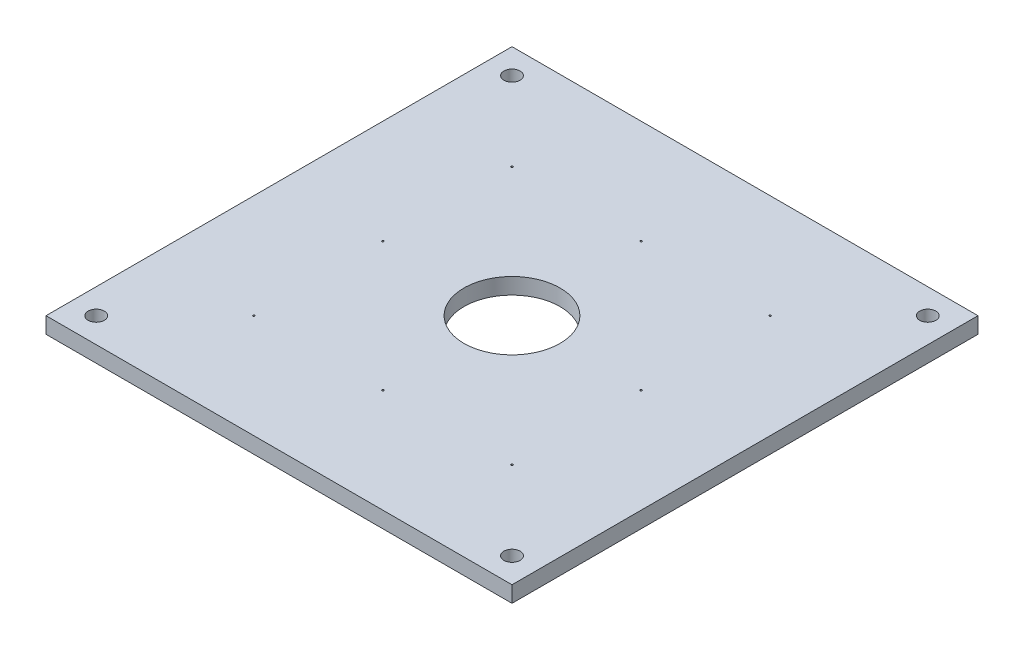
ISO-10303-21;
HEADER;
FILE_DESCRIPTION(('STEP AP214'),'2;1');
FILE_NAME('part.step','',(''),(''),'','','');
FILE_SCHEMA(('AUTOMOTIVE_DESIGN { 1 0 10303 214 1 1 1 1 }'));
ENDSEC;
DATA;
#1=APPLICATION_CONTEXT('core data for automotive mechanical design processes');
#2=APPLICATION_PROTOCOL_DEFINITION('international standard','automotive_design',2000,#1);
#3=PRODUCT_CONTEXT('',#1,'mechanical');
#4=PRODUCT('Part','Part','',(#3));
#5=PRODUCT_RELATED_PRODUCT_CATEGORY('part','',(#4));
#6=PRODUCT_DEFINITION_FORMATION('','',#4);
#7=PRODUCT_DEFINITION_CONTEXT('part definition',#1,'design');
#8=PRODUCT_DEFINITION('design','',#6,#7);
#9=PRODUCT_DEFINITION_SHAPE('','',#8);
#10=(LENGTH_UNIT() NAMED_UNIT(*) SI_UNIT(.MILLI.,.METRE.));
#11=(NAMED_UNIT(*) PLANE_ANGLE_UNIT() SI_UNIT($,.RADIAN.));
#12=(NAMED_UNIT(*) SI_UNIT($,.STERADIAN.) SOLID_ANGLE_UNIT());
#13=UNCERTAINTY_MEASURE_WITH_UNIT(LENGTH_MEASURE(1.E-05),#10,'distance_accuracy_value','');
#14=(GEOMETRIC_REPRESENTATION_CONTEXT(3) GLOBAL_UNCERTAINTY_ASSIGNED_CONTEXT((#13)) GLOBAL_UNIT_ASSIGNED_CONTEXT((#10,
#11,#12)) REPRESENTATION_CONTEXT('',''));
#15=CARTESIAN_POINT('',(0.,0.,0.));
#16=DIRECTION('',(0.,0.,1.));
#17=DIRECTION('',(1.,0.,0.));
#18=AXIS2_PLACEMENT_3D('',#15,#16,#17);
#19=CARTESIAN_POINT('',(0.,4.5,-130.));
#20=DIRECTION('',(0.,-1.,0.));
#21=DIRECTION('',(0.,0.,-1.));
#22=AXIS2_PLACEMENT_3D('',#19,#20,#21);
#23=PLANE('',#22);
#24=CARTESIAN_POINT('',(101.,4.5,-101.));
#25=DIRECTION('',(0.,-1.,0.));
#26=DIRECTION('',(0.,0.,-1.));
#27=AXIS2_PLACEMENT_3D('',#24,#25,#26);
#28=CIRCLE('',#27,0.25);
#29=CARTESIAN_POINT('',(101.,4.5,-101.25));
#30=VERTEX_POINT('',#29);
#31=EDGE_CURVE('E178',#30,#30,#28,.T.);
#32=ORIENTED_EDGE('',*,*,#31,.T.);
#33=EDGE_LOOP('',(#32));
#34=FACE_BOUND('',#33,.T.);
#35=CARTESIAN_POINT('',(29.0000000000004,4.5,-101.));
#36=DIRECTION('',(0.,-1.,0.));
#37=DIRECTION('',(0.,0.,-1.));
#38=AXIS2_PLACEMENT_3D('',#35,#36,#37);
#39=CIRCLE('',#38,0.25);
#40=CARTESIAN_POINT('',(29.0000000000004,4.5,-101.25));
#41=VERTEX_POINT('',#40);
#42=EDGE_CURVE('E172',#41,#41,#39,.T.);
#43=ORIENTED_EDGE('',*,*,#42,.T.);
#44=EDGE_LOOP('',(#43));
#45=FACE_BOUND('',#44,.T.);
#46=CARTESIAN_POINT('',(101.,4.5,-29.0000000000002));
#47=DIRECTION('',(0.,-1.,0.));
#48=DIRECTION('',(0.,0.,-1.));
#49=AXIS2_PLACEMENT_3D('',#46,#47,#48);
#50=CIRCLE('',#49,0.25);
#51=CARTESIAN_POINT('',(101.,4.5,-29.2500000000002));
#52=VERTEX_POINT('',#51);
#53=EDGE_CURVE('E166',#52,#52,#50,.T.);
#54=ORIENTED_EDGE('',*,*,#53,.T.);
#55=EDGE_LOOP('',(#54));
#56=FACE_BOUND('',#55,.T.);
#57=CARTESIAN_POINT('',(28.9999999999999,4.5,-29.));
#58=DIRECTION('',(0.,-1.,0.));
#59=DIRECTION('',(0.,0.,-1.));
#60=AXIS2_PLACEMENT_3D('',#57,#58,#59);
#61=CIRCLE('',#60,0.25);
#62=CARTESIAN_POINT('',(28.9999999999999,4.5,-29.25));
#63=VERTEX_POINT('',#62);
#64=EDGE_CURVE('E160',#63,#63,#61,.T.);
#65=ORIENTED_EDGE('',*,*,#64,.T.);
#66=EDGE_LOOP('',(#65));
#67=FACE_BOUND('',#66,.T.);
#68=CARTESIAN_POINT('',(64.9999999999996,4.5,-101.));
#69=DIRECTION('',(0.,-1.,0.));
#70=DIRECTION('',(0.,0.,-1.));
#71=AXIS2_PLACEMENT_3D('',#68,#69,#70);
#72=CIRCLE('',#71,0.249999999999986);
#73=CARTESIAN_POINT('',(64.9999999999996,4.5,-101.25));
#74=VERTEX_POINT('',#73);
#75=EDGE_CURVE('E154',#74,#74,#72,.T.);
#76=ORIENTED_EDGE('',*,*,#75,.T.);
#77=EDGE_LOOP('',(#76));
#78=FACE_BOUND('',#77,.T.);
#79=CARTESIAN_POINT('',(101.,4.5,-65.0000000000002));
#80=DIRECTION('',(0.,-1.,0.));
#81=DIRECTION('',(0.,0.,-1.));
#82=AXIS2_PLACEMENT_3D('',#79,#80,#81);
#83=CIRCLE('',#82,0.25);
#84=CARTESIAN_POINT('',(101.,4.5,-65.2500000000002));
#85=VERTEX_POINT('',#84);
#86=EDGE_CURVE('E148',#85,#85,#83,.T.);
#87=ORIENTED_EDGE('',*,*,#86,.T.);
#88=EDGE_LOOP('',(#87));
#89=FACE_BOUND('',#88,.T.);
#90=CARTESIAN_POINT('',(65.0000000000001,4.5,-29.));
#91=DIRECTION('',(0.,-1.,0.));
#92=DIRECTION('',(0.,0.,-1.));
#93=AXIS2_PLACEMENT_3D('',#90,#91,#92);
#94=CIRCLE('',#93,0.25);
#95=CARTESIAN_POINT('',(65.0000000000001,4.5,-29.25));
#96=VERTEX_POINT('',#95);
#97=EDGE_CURVE('E142',#96,#96,#94,.T.);
#98=ORIENTED_EDGE('',*,*,#97,.T.);
#99=EDGE_LOOP('',(#98));
#100=FACE_BOUND('',#99,.T.);
#101=CARTESIAN_POINT('',(29.,4.5,-65.));
#102=DIRECTION('',(0.,-1.,0.));
#103=DIRECTION('',(0.,0.,-1.));
#104=AXIS2_PLACEMENT_3D('',#101,#102,#103);
#105=CIRCLE('',#104,0.25);
#106=CARTESIAN_POINT('',(29.,4.5,-65.25));
#107=VERTEX_POINT('',#106);
#108=EDGE_CURVE('E136',#107,#107,#105,.T.);
#109=ORIENTED_EDGE('',*,*,#108,.T.);
#110=EDGE_LOOP('',(#109));
#111=FACE_BOUND('',#110,.T.);
#112=CARTESIAN_POINT('',(7.00000000000001,4.5,-7.00000000000001));
#113=DIRECTION('',(0.,1.,0.));
#114=DIRECTION('',(0.,0.,1.));
#115=AXIS2_PLACEMENT_3D('',#112,#113,#114);
#116=CIRCLE('',#115,2.24999999999917);
#117=CARTESIAN_POINT('',(7.00000000000001,4.5,-4.75000000000084));
#118=VERTEX_POINT('',#117);
#119=EDGE_CURVE('E124',#118,#118,#116,.T.);
#120=ORIENTED_EDGE('',*,*,#119,.F.);
#121=EDGE_LOOP('',(#120));
#122=FACE_BOUND('',#121,.T.);
#123=CARTESIAN_POINT('',(123.,4.5,-123.));
#124=DIRECTION('',(0.,1.,0.));
#125=DIRECTION('',(0.,0.,1.));
#126=AXIS2_PLACEMENT_3D('',#123,#124,#125);
#127=CIRCLE('',#126,2.25000000000001);
#128=CARTESIAN_POINT('',(123.,4.5,-120.75));
#129=VERTEX_POINT('',#128);
#130=EDGE_CURVE('E112',#129,#129,#127,.T.);
#131=ORIENTED_EDGE('',*,*,#130,.F.);
#132=EDGE_LOOP('',(#131));
#133=FACE_BOUND('',#132,.T.);
#134=DIRECTION('',(0.,0.,1.));
#135=VECTOR('',#134,1.);
#136=CARTESIAN_POINT('',(0.,4.5,0.));
#137=LINE('',#136,#135);
#138=CARTESIAN_POINT('',(0.,4.5,-130.));
#139=VERTEX_POINT('',#138);
#140=CARTESIAN_POINT('',(0.,4.5,0.));
#141=VERTEX_POINT('',#140);
#142=EDGE_CURVE('E82',#139,#141,#137,.T.);
#143=ORIENTED_EDGE('',*,*,#142,.T.);
#144=DIRECTION('',(1.,0.,0.));
#145=VECTOR('',#144,1.);
#146=CARTESIAN_POINT('',(0.,4.5,0.));
#147=LINE('',#146,#145);
#148=CARTESIAN_POINT('',(130.,4.5,0.));
#149=VERTEX_POINT('',#148);
#150=EDGE_CURVE('E77',#141,#149,#147,.T.);
#151=ORIENTED_EDGE('',*,*,#150,.T.);
#152=DIRECTION('',(0.,0.,-1.));
#153=VECTOR('',#152,1.);
#154=CARTESIAN_POINT('',(130.,4.5,0.));
#155=LINE('',#154,#153);
#156=CARTESIAN_POINT('',(130.,4.5,-130.));
#157=VERTEX_POINT('',#156);
#158=EDGE_CURVE('E80',#149,#157,#155,.T.);
#159=ORIENTED_EDGE('',*,*,#158,.T.);
#160=DIRECTION('',(-1.,0.,0.));
#161=VECTOR('',#160,1.);
#162=CARTESIAN_POINT('',(0.,4.5,-130.));
#163=LINE('',#162,#161);
#164=EDGE_CURVE('E47',#157,#139,#163,.T.);
#165=ORIENTED_EDGE('',*,*,#164,.T.);
#166=EDGE_LOOP('',(#143,#151,#159,#165));
#167=FACE_BOUND('',#166,.T.);
#168=CARTESIAN_POINT('',(65.,4.5,-65.));
#169=DIRECTION('',(0.,1.,0.));
#170=DIRECTION('',(0.,0.,1.));
#171=AXIS2_PLACEMENT_3D('',#168,#169,#170);
#172=CIRCLE('',#171,13.4);
#173=CARTESIAN_POINT('',(65.,4.5,-51.6));
#174=VERTEX_POINT('',#173);
#175=EDGE_CURVE('E97',#174,#174,#172,.T.);
#176=ORIENTED_EDGE('',*,*,#175,.F.);
#177=EDGE_LOOP('',(#176));
#178=FACE_BOUND('',#177,.T.);
#179=CARTESIAN_POINT('',(123.000000000001,4.5,-6.9999999999998));
#180=DIRECTION('',(0.,1.,0.));
#181=DIRECTION('',(0.,0.,1.));
#182=AXIS2_PLACEMENT_3D('',#179,#180,#181);
#183=CIRCLE('',#182,2.25000000000002);
#184=CARTESIAN_POINT('',(123.000000000001,4.5,-4.74999999999978));
#185=VERTEX_POINT('',#184);
#186=EDGE_CURVE('E118',#185,#185,#183,.T.);
#187=ORIENTED_EDGE('',*,*,#186,.F.);
#188=EDGE_LOOP('',(#187));
#189=FACE_BOUND('',#188,.T.);
#190=CARTESIAN_POINT('',(7.00000000000066,4.5,-122.999999999999));
#191=DIRECTION('',(0.,1.,0.));
#192=DIRECTION('',(0.,0.,1.));
#193=AXIS2_PLACEMENT_3D('',#190,#191,#192);
#194=CIRCLE('',#193,2.25000000000002);
#195=CARTESIAN_POINT('',(7.00000000000066,4.5,-120.749999999999));
#196=VERTEX_POINT('',#195);
#197=EDGE_CURVE('E130',#196,#196,#194,.T.);
#198=ORIENTED_EDGE('',*,*,#197,.F.);
#199=EDGE_LOOP('',(#198));
#200=FACE_BOUND('',#199,.T.);
#201=ADVANCED_FACE('F30',(#34,#45,#56,#67,#78,#89,#100,#111,#122,#133,#167,#178,#189,#200),#23,.F.);
#202=CARTESIAN_POINT('',(0.,0.,-130.));
#203=DIRECTION('',(0.,-1.,0.));
#204=DIRECTION('',(0.,0.,-1.));
#205=AXIS2_PLACEMENT_3D('',#202,#203,#204);
#206=PLANE('',#205);
#207=CARTESIAN_POINT('',(101.,0.,-101.));
#208=DIRECTION('',(0.,-1.,0.));
#209=DIRECTION('',(0.,0.,-1.));
#210=AXIS2_PLACEMENT_3D('',#207,#208,#209);
#211=CIRCLE('',#210,0.25);
#212=CARTESIAN_POINT('',(101.,0.,-101.25));
#213=VERTEX_POINT('',#212);
#214=EDGE_CURVE('E181',#213,#213,#211,.T.);
#215=ORIENTED_EDGE('',*,*,#214,.F.);
#216=EDGE_LOOP('',(#215));
#217=FACE_BOUND('',#216,.T.);
#218=CARTESIAN_POINT('',(29.0000000000004,0.,-101.));
#219=DIRECTION('',(0.,-1.,0.));
#220=DIRECTION('',(0.,0.,-1.));
#221=AXIS2_PLACEMENT_3D('',#218,#219,#220);
#222=CIRCLE('',#221,0.25);
#223=CARTESIAN_POINT('',(29.0000000000004,0.,-101.25));
#224=VERTEX_POINT('',#223);
#225=EDGE_CURVE('E175',#224,#224,#222,.T.);
#226=ORIENTED_EDGE('',*,*,#225,.F.);
#227=EDGE_LOOP('',(#226));
#228=FACE_BOUND('',#227,.T.);
#229=CARTESIAN_POINT('',(101.,0.,-29.0000000000002));
#230=DIRECTION('',(0.,-1.,0.));
#231=DIRECTION('',(0.,0.,-1.));
#232=AXIS2_PLACEMENT_3D('',#229,#230,#231);
#233=CIRCLE('',#232,0.25);
#234=CARTESIAN_POINT('',(101.,0.,-29.2500000000002));
#235=VERTEX_POINT('',#234);
#236=EDGE_CURVE('E169',#235,#235,#233,.T.);
#237=ORIENTED_EDGE('',*,*,#236,.F.);
#238=EDGE_LOOP('',(#237));
#239=FACE_BOUND('',#238,.T.);
#240=CARTESIAN_POINT('',(28.9999999999999,0.,-29.));
#241=DIRECTION('',(0.,-1.,0.));
#242=DIRECTION('',(0.,0.,-1.));
#243=AXIS2_PLACEMENT_3D('',#240,#241,#242);
#244=CIRCLE('',#243,0.25);
#245=CARTESIAN_POINT('',(28.9999999999999,0.,-29.25));
#246=VERTEX_POINT('',#245);
#247=EDGE_CURVE('E163',#246,#246,#244,.T.);
#248=ORIENTED_EDGE('',*,*,#247,.F.);
#249=EDGE_LOOP('',(#248));
#250=FACE_BOUND('',#249,.T.);
#251=CARTESIAN_POINT('',(64.9999999999996,0.,-101.));
#252=DIRECTION('',(0.,-1.,0.));
#253=DIRECTION('',(0.,0.,-1.));
#254=AXIS2_PLACEMENT_3D('',#251,#252,#253);
#255=CIRCLE('',#254,0.249999999999986);
#256=CARTESIAN_POINT('',(64.9999999999996,0.,-101.25));
#257=VERTEX_POINT('',#256);
#258=EDGE_CURVE('E157',#257,#257,#255,.T.);
#259=ORIENTED_EDGE('',*,*,#258,.F.);
#260=EDGE_LOOP('',(#259));
#261=FACE_BOUND('',#260,.T.);
#262=CARTESIAN_POINT('',(101.,0.,-65.0000000000002));
#263=DIRECTION('',(0.,-1.,0.));
#264=DIRECTION('',(0.,0.,-1.));
#265=AXIS2_PLACEMENT_3D('',#262,#263,#264);
#266=CIRCLE('',#265,0.25);
#267=CARTESIAN_POINT('',(101.,0.,-65.2500000000002));
#268=VERTEX_POINT('',#267);
#269=EDGE_CURVE('E151',#268,#268,#266,.T.);
#270=ORIENTED_EDGE('',*,*,#269,.F.);
#271=EDGE_LOOP('',(#270));
#272=FACE_BOUND('',#271,.T.);
#273=CARTESIAN_POINT('',(65.0000000000001,0.,-29.));
#274=DIRECTION('',(0.,-1.,0.));
#275=DIRECTION('',(0.,0.,-1.));
#276=AXIS2_PLACEMENT_3D('',#273,#274,#275);
#277=CIRCLE('',#276,0.25);
#278=CARTESIAN_POINT('',(65.0000000000001,0.,-29.25));
#279=VERTEX_POINT('',#278);
#280=EDGE_CURVE('E145',#279,#279,#277,.T.);
#281=ORIENTED_EDGE('',*,*,#280,.F.);
#282=EDGE_LOOP('',(#281));
#283=FACE_BOUND('',#282,.T.);
#284=CARTESIAN_POINT('',(29.,0.,-65.));
#285=DIRECTION('',(0.,-1.,0.));
#286=DIRECTION('',(0.,0.,-1.));
#287=AXIS2_PLACEMENT_3D('',#284,#285,#286);
#288=CIRCLE('',#287,0.25);
#289=CARTESIAN_POINT('',(29.,0.,-65.25));
#290=VERTEX_POINT('',#289);
#291=EDGE_CURVE('E139',#290,#290,#288,.T.);
#292=ORIENTED_EDGE('',*,*,#291,.F.);
#293=EDGE_LOOP('',(#292));
#294=FACE_BOUND('',#293,.T.);
#295=CARTESIAN_POINT('',(7.00000000000001,0.,-7.00000000000001));
#296=DIRECTION('',(0.,1.,0.));
#297=DIRECTION('',(0.,0.,1.));
#298=AXIS2_PLACEMENT_3D('',#295,#296,#297);
#299=CIRCLE('',#298,2.24999999999917);
#300=CARTESIAN_POINT('',(7.00000000000001,0.,-4.75000000000084));
#301=VERTEX_POINT('',#300);
#302=EDGE_CURVE('E127',#301,#301,#299,.T.);
#303=ORIENTED_EDGE('',*,*,#302,.T.);
#304=EDGE_LOOP('',(#303));
#305=FACE_BOUND('',#304,.T.);
#306=CARTESIAN_POINT('',(123.,0.,-123.));
#307=DIRECTION('',(0.,1.,0.));
#308=DIRECTION('',(0.,0.,1.));
#309=AXIS2_PLACEMENT_3D('',#306,#307,#308);
#310=CIRCLE('',#309,2.25000000000001);
#311=CARTESIAN_POINT('',(123.,0.,-120.75));
#312=VERTEX_POINT('',#311);
#313=EDGE_CURVE('E115',#312,#312,#310,.T.);
#314=ORIENTED_EDGE('',*,*,#313,.T.);
#315=EDGE_LOOP('',(#314));
#316=FACE_BOUND('',#315,.T.);
#317=DIRECTION('',(0.,0.,1.));
#318=VECTOR('',#317,1.);
#319=CARTESIAN_POINT('',(0.,0.,0.));
#320=LINE('',#319,#318);
#321=CARTESIAN_POINT('',(0.,0.,-130.));
#322=VERTEX_POINT('',#321);
#323=CARTESIAN_POINT('',(0.,0.,0.));
#324=VERTEX_POINT('',#323);
#325=EDGE_CURVE('E94',#322,#324,#320,.T.);
#326=ORIENTED_EDGE('',*,*,#325,.F.);
#327=DIRECTION('',(-1.,0.,0.));
#328=VECTOR('',#327,1.);
#329=CARTESIAN_POINT('',(0.,0.,-130.));
#330=LINE('',#329,#328);
#331=CARTESIAN_POINT('',(130.,0.,-130.));
#332=VERTEX_POINT('',#331);
#333=EDGE_CURVE('E70',#332,#322,#330,.T.);
#334=ORIENTED_EDGE('',*,*,#333,.F.);
#335=DIRECTION('',(0.,0.,-1.));
#336=VECTOR('',#335,1.);
#337=CARTESIAN_POINT('',(130.,0.,0.));
#338=LINE('',#337,#336);
#339=CARTESIAN_POINT('',(130.,0.,0.));
#340=VERTEX_POINT('',#339);
#341=EDGE_CURVE('E64',#340,#332,#338,.T.);
#342=ORIENTED_EDGE('',*,*,#341,.F.);
#343=DIRECTION('',(1.,0.,0.));
#344=VECTOR('',#343,1.);
#345=CARTESIAN_POINT('',(0.,0.,0.));
#346=LINE('',#345,#344);
#347=EDGE_CURVE('E86',#324,#340,#346,.T.);
#348=ORIENTED_EDGE('',*,*,#347,.F.);
#349=EDGE_LOOP('',(#326,#334,#342,#348));
#350=FACE_BOUND('',#349,.T.);
#351=CARTESIAN_POINT('',(65.,0.,-65.));
#352=DIRECTION('',(0.,1.,0.));
#353=DIRECTION('',(0.,0.,1.));
#354=AXIS2_PLACEMENT_3D('',#351,#352,#353);
#355=CIRCLE('',#354,13.4);
#356=CARTESIAN_POINT('',(65.,0.,-51.6));
#357=VERTEX_POINT('',#356);
#358=EDGE_CURVE('E109',#357,#357,#355,.T.);
#359=ORIENTED_EDGE('',*,*,#358,.T.);
#360=EDGE_LOOP('',(#359));
#361=FACE_BOUND('',#360,.T.);
#362=CARTESIAN_POINT('',(123.000000000001,0.,-6.9999999999998));
#363=DIRECTION('',(0.,1.,0.));
#364=DIRECTION('',(0.,0.,1.));
#365=AXIS2_PLACEMENT_3D('',#362,#363,#364);
#366=CIRCLE('',#365,2.25000000000002);
#367=CARTESIAN_POINT('',(123.000000000001,0.,-4.74999999999978));
#368=VERTEX_POINT('',#367);
#369=EDGE_CURVE('E121',#368,#368,#366,.T.);
#370=ORIENTED_EDGE('',*,*,#369,.T.);
#371=EDGE_LOOP('',(#370));
#372=FACE_BOUND('',#371,.T.);
#373=CARTESIAN_POINT('',(7.00000000000066,0.,-122.999999999999));
#374=DIRECTION('',(0.,1.,0.));
#375=DIRECTION('',(0.,0.,1.));
#376=AXIS2_PLACEMENT_3D('',#373,#374,#375);
#377=CIRCLE('',#376,2.25000000000002);
#378=CARTESIAN_POINT('',(7.00000000000066,0.,-120.749999999999));
#379=VERTEX_POINT('',#378);
#380=EDGE_CURVE('E133',#379,#379,#377,.T.);
#381=ORIENTED_EDGE('',*,*,#380,.T.);
#382=EDGE_LOOP('',(#381));
#383=FACE_BOUND('',#382,.T.);
#384=ADVANCED_FACE('F105',(#217,#228,#239,#250,#261,#272,#283,#294,#305,#316,#350,#361,#372,
#383),#206,.T.);
#385=CARTESIAN_POINT('',(0.,4.5,0.));
#386=DIRECTION('',(1.,0.,0.));
#387=DIRECTION('',(0.,0.,-1.));
#388=AXIS2_PLACEMENT_3D('',#385,#386,#387);
#389=PLANE('',#388);
#390=ORIENTED_EDGE('',*,*,#325,.T.);
#391=DIRECTION('',(0.,-1.,0.));
#392=VECTOR('',#391,1.);
#393=CARTESIAN_POINT('',(0.,4.5,0.));
#394=LINE('',#393,#392);
#395=EDGE_CURVE('E11',#141,#324,#394,.T.);
#396=ORIENTED_EDGE('',*,*,#395,.F.);
#397=ORIENTED_EDGE('',*,*,#142,.F.);
#398=DIRECTION('',(0.,-1.,0.));
#399=VECTOR('',#398,1.);
#400=CARTESIAN_POINT('',(0.,4.5,-130.));
#401=LINE('',#400,#399);
#402=EDGE_CURVE('E90',#139,#322,#401,.T.);
#403=ORIENTED_EDGE('',*,*,#402,.T.);
#404=EDGE_LOOP('',(#390,#396,#397,#403));
#405=FACE_BOUND('',#404,.T.);
#406=ADVANCED_FACE('F32',(#405),#389,.F.);
#407=CARTESIAN_POINT('',(0.,4.5,0.));
#408=DIRECTION('',(0.,0.,-1.));
#409=DIRECTION('',(-1.,0.,0.));
#410=AXIS2_PLACEMENT_3D('',#407,#408,#409);
#411=PLANE('',#410);
#412=ORIENTED_EDGE('',*,*,#347,.T.);
#413=DIRECTION('',(0.,-1.,0.));
#414=VECTOR('',#413,1.);
#415=CARTESIAN_POINT('',(130.,4.5,0.));
#416=LINE('',#415,#414);
#417=EDGE_CURVE('E39',#149,#340,#416,.T.);
#418=ORIENTED_EDGE('',*,*,#417,.F.);
#419=ORIENTED_EDGE('',*,*,#150,.F.);
#420=ORIENTED_EDGE('',*,*,#395,.T.);
#421=EDGE_LOOP('',(#412,#418,#419,#420));
#422=FACE_BOUND('',#421,.T.);
#423=ADVANCED_FACE('F85',(#422),#411,.F.);
#424=CARTESIAN_POINT('',(130.,4.5,0.));
#425=DIRECTION('',(-1.,0.,0.));
#426=DIRECTION('',(0.,0.,1.));
#427=AXIS2_PLACEMENT_3D('',#424,#425,#426);
#428=PLANE('',#427);
#429=ORIENTED_EDGE('',*,*,#341,.T.);
#430=DIRECTION('',(0.,-1.,0.));
#431=VECTOR('',#430,1.);
#432=CARTESIAN_POINT('',(130.,4.5,-130.));
#433=LINE('',#432,#431);
#434=EDGE_CURVE('E87',#157,#332,#433,.T.);
#435=ORIENTED_EDGE('',*,*,#434,.F.);
#436=ORIENTED_EDGE('',*,*,#158,.F.);
#437=ORIENTED_EDGE('',*,*,#417,.T.);
#438=EDGE_LOOP('',(#429,#435,#436,#437));
#439=FACE_BOUND('',#438,.T.);
#440=ADVANCED_FACE('F88',(#439),#428,.F.);
#441=CARTESIAN_POINT('',(0.,4.5,-130.));
#442=DIRECTION('',(0.,0.,1.));
#443=DIRECTION('',(1.,0.,0.));
#444=AXIS2_PLACEMENT_3D('',#441,#442,#443);
#445=PLANE('',#444);
#446=ORIENTED_EDGE('',*,*,#333,.T.);
#447=ORIENTED_EDGE('',*,*,#402,.F.);
#448=ORIENTED_EDGE('',*,*,#164,.F.);
#449=ORIENTED_EDGE('',*,*,#434,.T.);
#450=EDGE_LOOP('',(#446,#447,#448,#449));
#451=FACE_BOUND('',#450,.T.);
#452=ADVANCED_FACE('F102',(#451),#445,.F.);
#453=CARTESIAN_POINT('',(65.,4.5,-65.));
#454=DIRECTION('',(0.,-1.,0.));
#455=DIRECTION('',(0.,0.,-1.));
#456=AXIS2_PLACEMENT_3D('',#453,#454,#455);
#457=CYLINDRICAL_SURFACE('',#456,13.4);
#458=ORIENTED_EDGE('',*,*,#175,.T.);
#459=EDGE_LOOP('',(#458));
#460=FACE_BOUND('',#459,.T.);
#461=ORIENTED_EDGE('',*,*,#358,.F.);
#462=EDGE_LOOP('',(#461));
#463=FACE_BOUND('',#462,.T.);
#464=ADVANCED_FACE('F220',(#460,#463),#457,.F.);
#465=CARTESIAN_POINT('',(123.,4.5,-123.));
#466=DIRECTION('',(0.,-1.,0.));
#467=DIRECTION('',(0.,0.,-1.));
#468=AXIS2_PLACEMENT_3D('',#465,#466,#467);
#469=CYLINDRICAL_SURFACE('',#468,2.25000000000001);
#470=ORIENTED_EDGE('',*,*,#130,.T.);
#471=EDGE_LOOP('',(#470));
#472=FACE_BOUND('',#471,.T.);
#473=ORIENTED_EDGE('',*,*,#313,.F.);
#474=EDGE_LOOP('',(#473));
#475=FACE_BOUND('',#474,.T.);
#476=ADVANCED_FACE('F217',(#472,#475),#469,.F.);
#477=CARTESIAN_POINT('',(123.000000000001,4.5,-6.9999999999998));
#478=DIRECTION('',(0.,-1.,0.));
#479=DIRECTION('',(0.,0.,-1.));
#480=AXIS2_PLACEMENT_3D('',#477,#478,#479);
#481=CYLINDRICAL_SURFACE('',#480,2.25000000000002);
#482=ORIENTED_EDGE('',*,*,#186,.T.);
#483=EDGE_LOOP('',(#482));
#484=FACE_BOUND('',#483,.T.);
#485=ORIENTED_EDGE('',*,*,#369,.F.);
#486=EDGE_LOOP('',(#485));
#487=FACE_BOUND('',#486,.T.);
#488=ADVANCED_FACE('F219',(#484,#487),#481,.F.);
#489=CARTESIAN_POINT('',(7.00000000000001,4.5,-7.00000000000001));
#490=DIRECTION('',(0.,-1.,0.));
#491=DIRECTION('',(0.,0.,-1.));
#492=AXIS2_PLACEMENT_3D('',#489,#490,#491);
#493=CYLINDRICAL_SURFACE('',#492,2.24999999999917);
#494=ORIENTED_EDGE('',*,*,#119,.T.);
#495=EDGE_LOOP('',(#494));
#496=FACE_BOUND('',#495,.T.);
#497=ORIENTED_EDGE('',*,*,#302,.F.);
#498=EDGE_LOOP('',(#497));
#499=FACE_BOUND('',#498,.T.);
#500=ADVANCED_FACE('F227',(#496,#499),#493,.F.);
#501=CARTESIAN_POINT('',(7.00000000000066,4.5,-122.999999999999));
#502=DIRECTION('',(0.,-1.,0.));
#503=DIRECTION('',(0.,0.,-1.));
#504=AXIS2_PLACEMENT_3D('',#501,#502,#503);
#505=CYLINDRICAL_SURFACE('',#504,2.25000000000002);
#506=ORIENTED_EDGE('',*,*,#197,.T.);
#507=EDGE_LOOP('',(#506));
#508=FACE_BOUND('',#507,.T.);
#509=ORIENTED_EDGE('',*,*,#380,.F.);
#510=EDGE_LOOP('',(#509));
#511=FACE_BOUND('',#510,.T.);
#512=ADVANCED_FACE('F266',(#508,#511),#505,.F.);
#513=CARTESIAN_POINT('',(29.,4.5,-65.));
#514=DIRECTION('',(0.,-1.,0.));
#515=DIRECTION('',(0.,0.,-1.));
#516=AXIS2_PLACEMENT_3D('',#513,#514,#515);
#517=CYLINDRICAL_SURFACE('',#516,0.25);
#518=ORIENTED_EDGE('',*,*,#108,.F.);
#519=EDGE_LOOP('',(#518));
#520=FACE_BOUND('',#519,.T.);
#521=ORIENTED_EDGE('',*,*,#291,.T.);
#522=EDGE_LOOP('',(#521));
#523=FACE_BOUND('',#522,.T.);
#524=ADVANCED_FACE('F260',(#520,#523),#517,.F.);
#525=CARTESIAN_POINT('',(65.0000000000001,4.5,-29.));
#526=DIRECTION('',(0.,-1.,0.));
#527=DIRECTION('',(0.,0.,-1.));
#528=AXIS2_PLACEMENT_3D('',#525,#526,#527);
#529=CYLINDRICAL_SURFACE('',#528,0.25);
#530=ORIENTED_EDGE('',*,*,#97,.F.);
#531=EDGE_LOOP('',(#530));
#532=FACE_BOUND('',#531,.T.);
#533=ORIENTED_EDGE('',*,*,#280,.T.);
#534=EDGE_LOOP('',(#533));
#535=FACE_BOUND('',#534,.T.);
#536=ADVANCED_FACE('F265',(#532,#535),#529,.F.);
#537=CARTESIAN_POINT('',(101.,4.5,-65.0000000000002));
#538=DIRECTION('',(0.,-1.,0.));
#539=DIRECTION('',(0.,0.,-1.));
#540=AXIS2_PLACEMENT_3D('',#537,#538,#539);
#541=CYLINDRICAL_SURFACE('',#540,0.25);
#542=ORIENTED_EDGE('',*,*,#86,.F.);
#543=EDGE_LOOP('',(#542));
#544=FACE_BOUND('',#543,.T.);
#545=ORIENTED_EDGE('',*,*,#269,.T.);
#546=EDGE_LOOP('',(#545));
#547=FACE_BOUND('',#546,.T.);
#548=ADVANCED_FACE('F278',(#544,#547),#541,.F.);
#549=CARTESIAN_POINT('',(64.9999999999996,4.5,-101.));
#550=DIRECTION('',(0.,-1.,0.));
#551=DIRECTION('',(0.,0.,-1.));
#552=AXIS2_PLACEMENT_3D('',#549,#550,#551);
#553=CYLINDRICAL_SURFACE('',#552,0.249999999999986);
#554=ORIENTED_EDGE('',*,*,#75,.F.);
#555=EDGE_LOOP('',(#554));
#556=FACE_BOUND('',#555,.T.);
#557=ORIENTED_EDGE('',*,*,#258,.T.);
#558=EDGE_LOOP('',(#557));
#559=FACE_BOUND('',#558,.T.);
#560=ADVANCED_FACE('F288',(#556,#559),#553,.F.);
#561=CARTESIAN_POINT('',(28.9999999999999,4.5,-29.));
#562=DIRECTION('',(0.,-1.,0.));
#563=DIRECTION('',(0.,0.,-1.));
#564=AXIS2_PLACEMENT_3D('',#561,#562,#563);
#565=CYLINDRICAL_SURFACE('',#564,0.25);
#566=ORIENTED_EDGE('',*,*,#64,.F.);
#567=EDGE_LOOP('',(#566));
#568=FACE_BOUND('',#567,.T.);
#569=ORIENTED_EDGE('',*,*,#247,.T.);
#570=EDGE_LOOP('',(#569));
#571=FACE_BOUND('',#570,.T.);
#572=ADVANCED_FACE('F298',(#568,#571),#565,.F.);
#573=CARTESIAN_POINT('',(101.,4.5,-29.0000000000002));
#574=DIRECTION('',(0.,-1.,0.));
#575=DIRECTION('',(0.,0.,-1.));
#576=AXIS2_PLACEMENT_3D('',#573,#574,#575);
#577=CYLINDRICAL_SURFACE('',#576,0.25);
#578=ORIENTED_EDGE('',*,*,#53,.F.);
#579=EDGE_LOOP('',(#578));
#580=FACE_BOUND('',#579,.T.);
#581=ORIENTED_EDGE('',*,*,#236,.T.);
#582=EDGE_LOOP('',(#581));
#583=FACE_BOUND('',#582,.T.);
#584=ADVANCED_FACE('F308',(#580,#583),#577,.F.);
#585=CARTESIAN_POINT('',(29.0000000000004,4.5,-101.));
#586=DIRECTION('',(0.,-1.,0.));
#587=DIRECTION('',(0.,0.,-1.));
#588=AXIS2_PLACEMENT_3D('',#585,#586,#587);
#589=CYLINDRICAL_SURFACE('',#588,0.25);
#590=ORIENTED_EDGE('',*,*,#42,.F.);
#591=EDGE_LOOP('',(#590));
#592=FACE_BOUND('',#591,.T.);
#593=ORIENTED_EDGE('',*,*,#225,.T.);
#594=EDGE_LOOP('',(#593));
#595=FACE_BOUND('',#594,.T.);
#596=ADVANCED_FACE('F192',(#592,#595),#589,.F.);
#597=CARTESIAN_POINT('',(101.,4.5,-101.));
#598=DIRECTION('',(0.,-1.,0.));
#599=DIRECTION('',(0.,0.,-1.));
#600=AXIS2_PLACEMENT_3D('',#597,#598,#599);
#601=CYLINDRICAL_SURFACE('',#600,0.25);
#602=ORIENTED_EDGE('',*,*,#31,.F.);
#603=EDGE_LOOP('',(#602));
#604=FACE_BOUND('',#603,.T.);
#605=ORIENTED_EDGE('',*,*,#214,.T.);
#606=EDGE_LOOP('',(#605));
#607=FACE_BOUND('',#606,.T.);
#608=ADVANCED_FACE('F189',(#604,#607),#601,.F.);
#609=CLOSED_SHELL('',(#201,#384,#406,#423,#440,#452,#464,#476,#488,#500,#512,#524,#536,#548,
#560,#572,#584,#596,#608));
#610=MANIFOLD_SOLID_BREP('B2',#609);
#611=ADVANCED_BREP_SHAPE_REPRESENTATION('',(#18,#610),#14);
#612=SHAPE_DEFINITION_REPRESENTATION(#9,#611);
ENDSEC;
END-ISO-10303-21;
